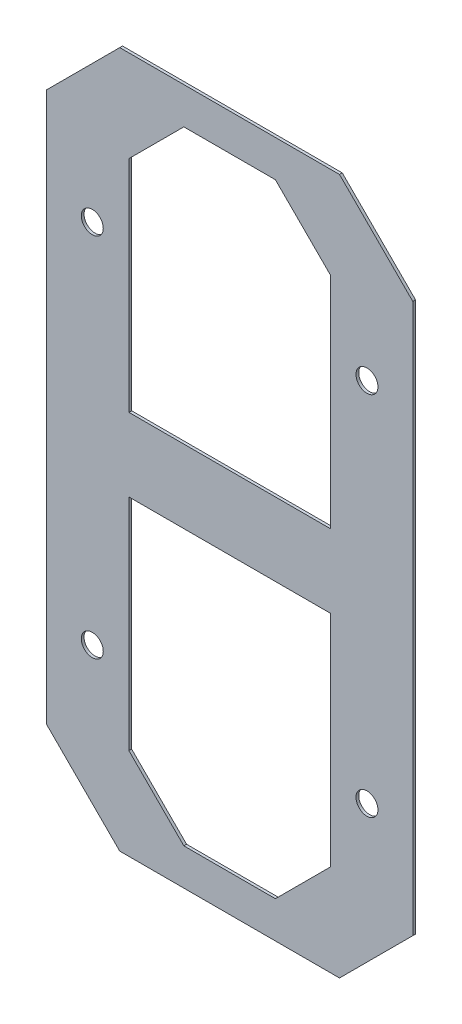
ISO-10303-21;
HEADER;
FILE_DESCRIPTION(('STEP AP214'),'2;1');
FILE_NAME('part.step','',(''),(''),'','','');
FILE_SCHEMA(('AUTOMOTIVE_DESIGN { 1 0 10303 214 1 1 1 1 }'));
ENDSEC;
DATA;
#1=APPLICATION_CONTEXT('core data for automotive mechanical design processes');
#2=APPLICATION_PROTOCOL_DEFINITION('international standard','automotive_design',2000,#1);
#3=PRODUCT_CONTEXT('',#1,'mechanical');
#4=PRODUCT('Part','Part','',(#3));
#5=PRODUCT_RELATED_PRODUCT_CATEGORY('part','',(#4));
#6=PRODUCT_DEFINITION_FORMATION('','',#4);
#7=PRODUCT_DEFINITION_CONTEXT('part definition',#1,'design');
#8=PRODUCT_DEFINITION('design','',#6,#7);
#9=PRODUCT_DEFINITION_SHAPE('','',#8);
#10=(LENGTH_UNIT() NAMED_UNIT(*) SI_UNIT(.MILLI.,.METRE.));
#11=(NAMED_UNIT(*) PLANE_ANGLE_UNIT() SI_UNIT($,.RADIAN.));
#12=(NAMED_UNIT(*) SI_UNIT($,.STERADIAN.) SOLID_ANGLE_UNIT());
#13=UNCERTAINTY_MEASURE_WITH_UNIT(LENGTH_MEASURE(1.E-05),#10,'distance_accuracy_value','');
#14=(GEOMETRIC_REPRESENTATION_CONTEXT(3) GLOBAL_UNCERTAINTY_ASSIGNED_CONTEXT((#13)) GLOBAL_UNIT_ASSIGNED_CONTEXT((#10,
#11,#12)) REPRESENTATION_CONTEXT('',''));
#15=CARTESIAN_POINT('',(0.,0.,0.));
#16=DIRECTION('',(0.,0.,1.));
#17=DIRECTION('',(1.,0.,0.));
#18=AXIS2_PLACEMENT_3D('',#15,#16,#17);
#19=CARTESIAN_POINT('',(-254.,482.6,3.81));
#20=DIRECTION('',(0.,1.,0.));
#21=DIRECTION('',(0.,0.,1.));
#22=AXIS2_PLACEMENT_3D('',#19,#20,#21);
#23=PLANE('',#22);
#24=DIRECTION('',(1.,0.,0.));
#25=VECTOR('',#24,1.);
#26=CARTESIAN_POINT('',(-254.,482.6,0.));
#27=LINE('',#26,#25);
#28=CARTESIAN_POINT('',(-152.4,482.6,0.));
#29=VERTEX_POINT('',#28);
#30=CARTESIAN_POINT('',(152.4,482.6,0.));
#31=VERTEX_POINT('',#30);
#32=EDGE_CURVE('E352',#29,#31,#27,.T.);
#33=ORIENTED_EDGE('',*,*,#32,.F.);
#34=DIRECTION('',(0.,0.,1.));
#35=VECTOR('',#34,1.);
#36=CARTESIAN_POINT('',(-152.4,482.6,3.81));
#37=LINE('',#36,#35);
#38=CARTESIAN_POINT('',(-152.4,482.6,3.81));
#39=VERTEX_POINT('',#38);
#40=EDGE_CURVE('E407',#29,#39,#37,.T.);
#41=ORIENTED_EDGE('',*,*,#40,.T.);
#42=DIRECTION('',(1.,0.,0.));
#43=VECTOR('',#42,1.);
#44=CARTESIAN_POINT('',(-254.,482.6,3.81));
#45=LINE('',#44,#43);
#46=CARTESIAN_POINT('',(152.4,482.6,3.81));
#47=VERTEX_POINT('',#46);
#48=EDGE_CURVE('E353',#39,#47,#45,.T.);
#49=ORIENTED_EDGE('',*,*,#48,.T.);
#50=DIRECTION('',(0.,0.,-1.));
#51=VECTOR('',#50,1.);
#52=CARTESIAN_POINT('',(152.4,482.6,3.81));
#53=LINE('',#52,#51);
#54=EDGE_CURVE('E403',#47,#31,#53,.T.);
#55=ORIENTED_EDGE('',*,*,#54,.T.);
#56=EDGE_LOOP('',(#33,#41,#49,#55));
#57=FACE_BOUND('',#56,.T.);
#58=ADVANCED_FACE('F45',(#57),#23,.T.);
#59=CARTESIAN_POINT('',(-254.,482.6,3.81));
#60=DIRECTION('',(1.,0.,0.));
#61=DIRECTION('',(0.,1.,0.));
#62=AXIS2_PLACEMENT_3D('',#59,#60,#61);
#63=PLANE('',#62);
#64=DIRECTION('',(0.,-1.,0.));
#65=VECTOR('',#64,1.);
#66=CARTESIAN_POINT('',(-254.,482.6,3.81));
#67=LINE('',#66,#65);
#68=CARTESIAN_POINT('',(-254.,381.,3.81));
#69=VERTEX_POINT('',#68);
#70=CARTESIAN_POINT('',(-254.,-380.999999999999,3.81));
#71=VERTEX_POINT('',#70);
#72=EDGE_CURVE('E366',#69,#71,#67,.T.);
#73=ORIENTED_EDGE('',*,*,#72,.F.);
#74=DIRECTION('',(0.,0.,-1.));
#75=VECTOR('',#74,1.);
#76=CARTESIAN_POINT('',(-254.,381.,0.));
#77=LINE('',#76,#75);
#78=CARTESIAN_POINT('',(-254.,381.,0.));
#79=VERTEX_POINT('',#78);
#80=EDGE_CURVE('E387',#69,#79,#77,.T.);
#81=ORIENTED_EDGE('',*,*,#80,.T.);
#82=DIRECTION('',(0.,-1.,0.));
#83=VECTOR('',#82,1.);
#84=CARTESIAN_POINT('',(-254.,482.6,0.));
#85=LINE('',#84,#83);
#86=CARTESIAN_POINT('',(-254.,-380.999999999999,0.));
#87=VERTEX_POINT('',#86);
#88=EDGE_CURVE('E358',#79,#87,#85,.T.);
#89=ORIENTED_EDGE('',*,*,#88,.T.);
#90=DIRECTION('',(0.,0.,1.));
#91=VECTOR('',#90,1.);
#92=CARTESIAN_POINT('',(-254.,-380.999999999999,3.81));
#93=LINE('',#92,#91);
#94=EDGE_CURVE('E370',#87,#71,#93,.T.);
#95=ORIENTED_EDGE('',*,*,#94,.T.);
#96=EDGE_LOOP('',(#73,#81,#89,#95));
#97=FACE_BOUND('',#96,.T.);
#98=ADVANCED_FACE('F465',(#97),#63,.F.);
#99=CARTESIAN_POINT('',(-254.,-482.6,3.81));
#100=DIRECTION('',(0.,1.,0.));
#101=DIRECTION('',(0.,0.,1.));
#102=AXIS2_PLACEMENT_3D('',#99,#100,#101);
#103=PLANE('',#102);
#104=DIRECTION('',(1.,0.,0.));
#105=VECTOR('',#104,1.);
#106=CARTESIAN_POINT('',(-254.,-482.6,0.));
#107=LINE('',#106,#105);
#108=CARTESIAN_POINT('',(-152.4,-482.6,0.));
#109=VERTEX_POINT('',#108);
#110=CARTESIAN_POINT('',(152.4,-482.6,0.));
#111=VERTEX_POINT('',#110);
#112=EDGE_CURVE('E378',#109,#111,#107,.T.);
#113=ORIENTED_EDGE('',*,*,#112,.T.);
#114=DIRECTION('',(0.,0.,1.));
#115=VECTOR('',#114,1.);
#116=CARTESIAN_POINT('',(152.4,-482.6,3.81));
#117=LINE('',#116,#115);
#118=CARTESIAN_POINT('',(152.4,-482.6,3.81));
#119=VERTEX_POINT('',#118);
#120=EDGE_CURVE('E11',#111,#119,#117,.T.);
#121=ORIENTED_EDGE('',*,*,#120,.T.);
#122=DIRECTION('',(1.,0.,0.));
#123=VECTOR('',#122,1.);
#124=CARTESIAN_POINT('',(-254.,-482.6,3.81));
#125=LINE('',#124,#123);
#126=CARTESIAN_POINT('',(-152.4,-482.6,3.81));
#127=VERTEX_POINT('',#126);
#128=EDGE_CURVE('E362',#127,#119,#125,.T.);
#129=ORIENTED_EDGE('',*,*,#128,.F.);
#130=DIRECTION('',(0.,0.,-1.));
#131=VECTOR('',#130,1.);
#132=CARTESIAN_POINT('',(-152.4,-482.6,3.81));
#133=LINE('',#132,#131);
#134=EDGE_CURVE('E55',#127,#109,#133,.T.);
#135=ORIENTED_EDGE('',*,*,#134,.T.);
#136=EDGE_LOOP('',(#113,#121,#129,#135));
#137=FACE_BOUND('',#136,.T.);
#138=ADVANCED_FACE('F434',(#137),#103,.F.);
#139=CARTESIAN_POINT('',(254.,482.6,3.81));
#140=DIRECTION('',(1.,0.,0.));
#141=DIRECTION('',(0.,1.,0.));
#142=AXIS2_PLACEMENT_3D('',#139,#140,#141);
#143=PLANE('',#142);
#144=DIRECTION('',(0.,-1.,0.));
#145=VECTOR('',#144,1.);
#146=CARTESIAN_POINT('',(254.,482.6,0.));
#147=LINE('',#146,#145);
#148=CARTESIAN_POINT('',(254.,381.,0.));
#149=VERTEX_POINT('',#148);
#150=CARTESIAN_POINT('',(254.,-381.,0.));
#151=VERTEX_POINT('',#150);
#152=EDGE_CURVE('E374',#149,#151,#147,.T.);
#153=ORIENTED_EDGE('',*,*,#152,.F.);
#154=DIRECTION('',(0.,0.,1.));
#155=VECTOR('',#154,1.);
#156=CARTESIAN_POINT('',(254.,381.,3.81));
#157=LINE('',#156,#155);
#158=CARTESIAN_POINT('',(254.,381.,3.81));
#159=VERTEX_POINT('',#158);
#160=EDGE_CURVE('E426',#149,#159,#157,.T.);
#161=ORIENTED_EDGE('',*,*,#160,.T.);
#162=DIRECTION('',(0.,-1.,0.));
#163=VECTOR('',#162,1.);
#164=CARTESIAN_POINT('',(254.,482.6,3.81));
#165=LINE('',#164,#163);
#166=CARTESIAN_POINT('',(254.,-381.,3.81));
#167=VERTEX_POINT('',#166);
#168=EDGE_CURVE('E357',#159,#167,#165,.T.);
#169=ORIENTED_EDGE('',*,*,#168,.T.);
#170=DIRECTION('',(0.,0.,-1.));
#171=VECTOR('',#170,1.);
#172=CARTESIAN_POINT('',(254.,-381.,0.));
#173=LINE('',#172,#171);
#174=EDGE_CURVE('E422',#167,#151,#173,.T.);
#175=ORIENTED_EDGE('',*,*,#174,.T.);
#176=EDGE_LOOP('',(#153,#161,#169,#175));
#177=FACE_BOUND('',#176,.T.);
#178=ADVANCED_FACE('F446',(#177),#143,.T.);
#179=CARTESIAN_POINT('',(0.,0.,3.81));
#180=DIRECTION('',(0.,0.,-1.));
#181=DIRECTION('',(-1.,0.,0.));
#182=AXIS2_PLACEMENT_3D('',#179,#180,#181);
#183=PLANE('',#182);
#184=DIRECTION('',(-0.707106781186548,0.707106781186547,0.));
#185=VECTOR('',#184,1.);
#186=CARTESIAN_POINT('',(63.4999999999999,431.8,3.81));
#187=LINE('',#186,#185);
#188=CARTESIAN_POINT('',(139.7,355.6,3.81));
#189=VERTEX_POINT('',#188);
#190=CARTESIAN_POINT('',(63.4999999999999,431.8,3.81));
#191=VERTEX_POINT('',#190);
#192=EDGE_CURVE('E228',#189,#191,#187,.T.);
#193=ORIENTED_EDGE('',*,*,#192,.F.);
#194=DIRECTION('',(0.,1.,0.));
#195=VECTOR('',#194,1.);
#196=CARTESIAN_POINT('',(139.7,355.6,3.81));
#197=LINE('',#196,#195);
#198=CARTESIAN_POINT('',(139.7,50.8,3.81));
#199=VERTEX_POINT('',#198);
#200=EDGE_CURVE('E62',#199,#189,#197,.T.);
#201=ORIENTED_EDGE('',*,*,#200,.F.);
#202=DIRECTION('',(1.,0.,0.));
#203=VECTOR('',#202,1.);
#204=CARTESIAN_POINT('',(-139.7,50.8,3.81));
#205=LINE('',#204,#203);
#206=CARTESIAN_POINT('',(-139.7,50.8,3.81));
#207=VERTEX_POINT('',#206);
#208=EDGE_CURVE('E208',#207,#199,#205,.T.);
#209=ORIENTED_EDGE('',*,*,#208,.F.);
#210=DIRECTION('',(0.,-1.,0.));
#211=VECTOR('',#210,1.);
#212=CARTESIAN_POINT('',(-139.7,355.6,3.81));
#213=LINE('',#212,#211);
#214=CARTESIAN_POINT('',(-139.7,355.6,3.81));
#215=VERTEX_POINT('',#214);
#216=EDGE_CURVE('E212',#215,#207,#213,.T.);
#217=ORIENTED_EDGE('',*,*,#216,.F.);
#218=DIRECTION('',(-0.707106781186548,-0.707106781186548,0.));
#219=VECTOR('',#218,1.);
#220=CARTESIAN_POINT('',(-139.7,355.6,3.81));
#221=LINE('',#220,#219);
#222=CARTESIAN_POINT('',(-63.5000000000001,431.8,3.81));
#223=VERTEX_POINT('',#222);
#224=EDGE_CURVE('E235',#223,#215,#221,.T.);
#225=ORIENTED_EDGE('',*,*,#224,.F.);
#226=DIRECTION('',(-1.,0.,0.));
#227=VECTOR('',#226,1.);
#228=CARTESIAN_POINT('',(-63.5000000000001,431.8,3.81));
#229=LINE('',#228,#227);
#230=EDGE_CURVE('E231',#191,#223,#229,.T.);
#231=ORIENTED_EDGE('',*,*,#230,.F.);
#232=EDGE_LOOP('',(#193,#201,#209,#217,#225,#231));
#233=FACE_BOUND('',#232,.T.);
#234=DIRECTION('',(0.707106781186547,-0.707106781186548,0.));
#235=VECTOR('',#234,1.);
#236=CARTESIAN_POINT('',(-63.5000000000001,-431.8,3.81));
#237=LINE('',#236,#235);
#238=CARTESIAN_POINT('',(-139.7,-355.6,3.81));
#239=VERTEX_POINT('',#238);
#240=CARTESIAN_POINT('',(-63.5000000000001,-431.8,3.81));
#241=VERTEX_POINT('',#240);
#242=EDGE_CURVE('E293',#239,#241,#237,.T.);
#243=ORIENTED_EDGE('',*,*,#242,.F.);
#244=DIRECTION('',(0.,-1.,0.));
#245=VECTOR('',#244,1.);
#246=CARTESIAN_POINT('',(-139.7,-355.6,3.81));
#247=LINE('',#246,#245);
#248=CARTESIAN_POINT('',(-139.7,-50.8,3.81));
#249=VERTEX_POINT('',#248);
#250=EDGE_CURVE('E70',#249,#239,#247,.T.);
#251=ORIENTED_EDGE('',*,*,#250,.F.);
#252=DIRECTION('',(-1.,0.,0.));
#253=VECTOR('',#252,1.);
#254=CARTESIAN_POINT('',(-139.7,-50.8,3.81));
#255=LINE('',#254,#253);
#256=CARTESIAN_POINT('',(139.7,-50.8,3.81));
#257=VERTEX_POINT('',#256);
#258=EDGE_CURVE('E276',#257,#249,#255,.T.);
#259=ORIENTED_EDGE('',*,*,#258,.F.);
#260=DIRECTION('',(0.,1.,0.));
#261=VECTOR('',#260,1.);
#262=CARTESIAN_POINT('',(139.7,-355.6,3.81));
#263=LINE('',#262,#261);
#264=CARTESIAN_POINT('',(139.7,-355.6,3.81));
#265=VERTEX_POINT('',#264);
#266=EDGE_CURVE('E280',#265,#257,#263,.T.);
#267=ORIENTED_EDGE('',*,*,#266,.F.);
#268=DIRECTION('',(0.707106781186548,0.707106781186547,0.));
#269=VECTOR('',#268,1.);
#270=CARTESIAN_POINT('',(63.4999999999999,-431.8,3.81));
#271=LINE('',#270,#269);
#272=CARTESIAN_POINT('',(63.4999999999999,-431.8,3.81));
#273=VERTEX_POINT('',#272);
#274=EDGE_CURVE('E285',#273,#265,#271,.T.);
#275=ORIENTED_EDGE('',*,*,#274,.F.);
#276=DIRECTION('',(1.,0.,0.));
#277=VECTOR('',#276,1.);
#278=CARTESIAN_POINT('',(-63.5000000000001,-431.8,3.81));
#279=LINE('',#278,#277);
#280=EDGE_CURVE('E289',#241,#273,#279,.T.);
#281=ORIENTED_EDGE('',*,*,#280,.F.);
#282=EDGE_LOOP('',(#243,#251,#259,#267,#275,#281));
#283=FACE_BOUND('',#282,.T.);
#284=CARTESIAN_POINT('',(-190.5,254.,3.81));
#285=DIRECTION('',(0.,0.,1.));
#286=DIRECTION('',(1.,0.,0.));
#287=AXIS2_PLACEMENT_3D('',#284,#285,#286);
#288=CIRCLE('',#287,15.24);
#289=CARTESIAN_POINT('',(-175.26,254.,3.81));
#290=VERTEX_POINT('',#289);
#291=EDGE_CURVE('E245',#290,#290,#288,.T.);
#292=ORIENTED_EDGE('',*,*,#291,.F.);
#293=EDGE_LOOP('',(#292));
#294=FACE_BOUND('',#293,.T.);
#295=CARTESIAN_POINT('',(190.5,254.,3.81));
#296=DIRECTION('',(0.,0.,1.));
#297=DIRECTION('',(1.,0.,0.));
#298=AXIS2_PLACEMENT_3D('',#295,#296,#297);
#299=CIRCLE('',#298,15.24);
#300=CARTESIAN_POINT('',(205.74,254.,3.81));
#301=VERTEX_POINT('',#300);
#302=EDGE_CURVE('E328',#301,#301,#299,.T.);
#303=ORIENTED_EDGE('',*,*,#302,.F.);
#304=EDGE_LOOP('',(#303));
#305=FACE_BOUND('',#304,.T.);
#306=CARTESIAN_POINT('',(190.5,-254.,3.81));
#307=DIRECTION('',(0.,0.,1.));
#308=DIRECTION('',(1.,0.,0.));
#309=AXIS2_PLACEMENT_3D('',#306,#307,#308);
#310=CIRCLE('',#309,15.24);
#311=CARTESIAN_POINT('',(205.74,-254.,3.81));
#312=VERTEX_POINT('',#311);
#313=EDGE_CURVE('E336',#312,#312,#310,.T.);
#314=ORIENTED_EDGE('',*,*,#313,.F.);
#315=EDGE_LOOP('',(#314));
#316=FACE_BOUND('',#315,.T.);
#317=CARTESIAN_POINT('',(-190.5,-254.,3.81));
#318=DIRECTION('',(0.,0.,1.));
#319=DIRECTION('',(1.,0.,0.));
#320=AXIS2_PLACEMENT_3D('',#317,#318,#319);
#321=CIRCLE('',#320,15.24);
#322=CARTESIAN_POINT('',(-175.26,-254.,3.81));
#323=VERTEX_POINT('',#322);
#324=EDGE_CURVE('E344',#323,#323,#321,.T.);
#325=ORIENTED_EDGE('',*,*,#324,.F.);
#326=EDGE_LOOP('',(#325));
#327=FACE_BOUND('',#326,.T.);
#328=ORIENTED_EDGE('',*,*,#48,.F.);
#329=DIRECTION('',(-0.707106781186548,-0.707106781186547,0.));
#330=VECTOR('',#329,1.);
#331=CARTESIAN_POINT('',(-254.,381.,3.81));
#332=LINE('',#331,#330);
#333=EDGE_CURVE('E419',#39,#69,#332,.T.);
#334=ORIENTED_EDGE('',*,*,#333,.T.);
#335=ORIENTED_EDGE('',*,*,#72,.T.);
#336=DIRECTION('',(-0.707106781186546,0.707106781186549,0.));
#337=VECTOR('',#336,1.);
#338=CARTESIAN_POINT('',(-152.4,-482.6,3.81));
#339=LINE('',#338,#337);
#340=EDGE_CURVE('E410',#71,#127,#339,.F.);
#341=ORIENTED_EDGE('',*,*,#340,.T.);
#342=ORIENTED_EDGE('',*,*,#128,.T.);
#343=DIRECTION('',(0.707106781186548,0.707106781186547,0.));
#344=VECTOR('',#343,1.);
#345=CARTESIAN_POINT('',(254.,-381.,3.81));
#346=LINE('',#345,#344);
#347=EDGE_CURVE('E413',#119,#167,#346,.T.);
#348=ORIENTED_EDGE('',*,*,#347,.T.);
#349=ORIENTED_EDGE('',*,*,#168,.F.);
#350=DIRECTION('',(0.707106781186546,-0.707106781186549,0.));
#351=VECTOR('',#350,1.);
#352=CARTESIAN_POINT('',(152.4,482.6,3.81));
#353=LINE('',#352,#351);
#354=EDGE_CURVE('E416',#159,#47,#353,.F.);
#355=ORIENTED_EDGE('',*,*,#354,.T.);
#356=EDGE_LOOP('',(#328,#334,#335,#341,#342,#348,#349,#355));
#357=FACE_BOUND('',#356,.T.);
#358=ADVANCED_FACE('F452',(#233,#283,#294,#305,#316,#327,#357),#183,.F.);
#359=CARTESIAN_POINT('',(0.,0.,0.));
#360=DIRECTION('',(0.,0.,-1.));
#361=DIRECTION('',(-1.,0.,0.));
#362=AXIS2_PLACEMENT_3D('',#359,#360,#361);
#363=PLANE('',#362);
#364=DIRECTION('',(0.,1.,0.));
#365=VECTOR('',#364,1.);
#366=CARTESIAN_POINT('',(139.7,355.6,0.));
#367=LINE('',#366,#365);
#368=CARTESIAN_POINT('',(139.7,50.8,0.));
#369=VERTEX_POINT('',#368);
#370=CARTESIAN_POINT('',(139.7,355.6,0.));
#371=VERTEX_POINT('',#370);
#372=EDGE_CURVE('E185',#369,#371,#367,.T.);
#373=ORIENTED_EDGE('',*,*,#372,.T.);
#374=DIRECTION('',(-0.707106781186548,0.707106781186547,0.));
#375=VECTOR('',#374,1.);
#376=CARTESIAN_POINT('',(63.4999999999999,431.8,0.));
#377=LINE('',#376,#375);
#378=CARTESIAN_POINT('',(63.4999999999999,431.8,0.));
#379=VERTEX_POINT('',#378);
#380=EDGE_CURVE('E196',#371,#379,#377,.T.);
#381=ORIENTED_EDGE('',*,*,#380,.T.);
#382=DIRECTION('',(-1.,0.,0.));
#383=VECTOR('',#382,1.);
#384=CARTESIAN_POINT('',(-63.5000000000001,431.8,0.));
#385=LINE('',#384,#383);
#386=CARTESIAN_POINT('',(-63.5000000000001,431.8,0.));
#387=VERTEX_POINT('',#386);
#388=EDGE_CURVE('E201',#379,#387,#385,.T.);
#389=ORIENTED_EDGE('',*,*,#388,.T.);
#390=DIRECTION('',(-0.707106781186548,-0.707106781186548,0.));
#391=VECTOR('',#390,1.);
#392=CARTESIAN_POINT('',(-139.7,355.6,0.));
#393=LINE('',#392,#391);
#394=CARTESIAN_POINT('',(-139.7,355.6,0.));
#395=VERTEX_POINT('',#394);
#396=EDGE_CURVE('E217',#387,#395,#393,.T.);
#397=ORIENTED_EDGE('',*,*,#396,.T.);
#398=DIRECTION('',(0.,-1.,0.));
#399=VECTOR('',#398,1.);
#400=CARTESIAN_POINT('',(-139.7,355.6,0.));
#401=LINE('',#400,#399);
#402=CARTESIAN_POINT('',(-139.7,50.8,0.));
#403=VERTEX_POINT('',#402);
#404=EDGE_CURVE('E221',#395,#403,#401,.T.);
#405=ORIENTED_EDGE('',*,*,#404,.T.);
#406=DIRECTION('',(1.,0.,0.));
#407=VECTOR('',#406,1.);
#408=CARTESIAN_POINT('',(-139.7,50.8,0.));
#409=LINE('',#408,#407);
#410=EDGE_CURVE('E192',#403,#369,#409,.T.);
#411=ORIENTED_EDGE('',*,*,#410,.T.);
#412=EDGE_LOOP('',(#373,#381,#389,#397,#405,#411));
#413=FACE_BOUND('',#412,.T.);
#414=DIRECTION('',(0.,-1.,0.));
#415=VECTOR('',#414,1.);
#416=CARTESIAN_POINT('',(-139.7,-355.6,0.));
#417=LINE('',#416,#415);
#418=CARTESIAN_POINT('',(-139.7,-50.8,0.));
#419=VERTEX_POINT('',#418);
#420=CARTESIAN_POINT('',(-139.7,-355.6,0.));
#421=VERTEX_POINT('',#420);
#422=EDGE_CURVE('E281',#419,#421,#417,.T.);
#423=ORIENTED_EDGE('',*,*,#422,.T.);
#424=DIRECTION('',(0.707106781186547,-0.707106781186548,0.));
#425=VECTOR('',#424,1.);
#426=CARTESIAN_POINT('',(-63.5000000000001,-431.8,0.));
#427=LINE('',#426,#425);
#428=CARTESIAN_POINT('',(-63.5000000000001,-431.8,0.));
#429=VERTEX_POINT('',#428);
#430=EDGE_CURVE('E314',#421,#429,#427,.T.);
#431=ORIENTED_EDGE('',*,*,#430,.T.);
#432=DIRECTION('',(1.,0.,0.));
#433=VECTOR('',#432,1.);
#434=CARTESIAN_POINT('',(-63.5000000000001,-431.8,0.));
#435=LINE('',#434,#433);
#436=CARTESIAN_POINT('',(63.4999999999999,-431.8,0.));
#437=VERTEX_POINT('',#436);
#438=EDGE_CURVE('E310',#429,#437,#435,.T.);
#439=ORIENTED_EDGE('',*,*,#438,.T.);
#440=DIRECTION('',(0.707106781186548,0.707106781186547,0.));
#441=VECTOR('',#440,1.);
#442=CARTESIAN_POINT('',(63.4999999999999,-431.8,0.));
#443=LINE('',#442,#441);
#444=CARTESIAN_POINT('',(139.7,-355.6,0.));
#445=VERTEX_POINT('',#444);
#446=EDGE_CURVE('E306',#437,#445,#443,.T.);
#447=ORIENTED_EDGE('',*,*,#446,.T.);
#448=DIRECTION('',(0.,1.,0.));
#449=VECTOR('',#448,1.);
#450=CARTESIAN_POINT('',(139.7,-355.6,0.));
#451=LINE('',#450,#449);
#452=CARTESIAN_POINT('',(139.7,-50.8,0.));
#453=VERTEX_POINT('',#452);
#454=EDGE_CURVE('E302',#445,#453,#451,.T.);
#455=ORIENTED_EDGE('',*,*,#454,.T.);
#456=DIRECTION('',(-1.,0.,0.));
#457=VECTOR('',#456,1.);
#458=CARTESIAN_POINT('',(-139.7,-50.8,0.));
#459=LINE('',#458,#457);
#460=EDGE_CURVE('E260',#453,#419,#459,.T.);
#461=ORIENTED_EDGE('',*,*,#460,.T.);
#462=EDGE_LOOP('',(#423,#431,#439,#447,#455,#461));
#463=FACE_BOUND('',#462,.T.);
#464=CARTESIAN_POINT('',(-190.5,254.,0.));
#465=DIRECTION('',(0.,0.,1.));
#466=DIRECTION('',(1.,0.,0.));
#467=AXIS2_PLACEMENT_3D('',#464,#465,#466);
#468=CIRCLE('',#467,15.24);
#469=CARTESIAN_POINT('',(-175.26,254.,0.));
#470=VERTEX_POINT('',#469);
#471=EDGE_CURVE('E324',#470,#470,#468,.T.);
#472=ORIENTED_EDGE('',*,*,#471,.T.);
#473=EDGE_LOOP('',(#472));
#474=FACE_BOUND('',#473,.T.);
#475=CARTESIAN_POINT('',(190.5,254.,0.));
#476=DIRECTION('',(0.,0.,1.));
#477=DIRECTION('',(1.,0.,0.));
#478=AXIS2_PLACEMENT_3D('',#475,#476,#477);
#479=CIRCLE('',#478,15.24);
#480=CARTESIAN_POINT('',(205.74,254.,0.));
#481=VERTEX_POINT('',#480);
#482=EDGE_CURVE('E332',#481,#481,#479,.T.);
#483=ORIENTED_EDGE('',*,*,#482,.T.);
#484=EDGE_LOOP('',(#483));
#485=FACE_BOUND('',#484,.T.);
#486=CARTESIAN_POINT('',(190.5,-254.,0.));
#487=DIRECTION('',(0.,0.,1.));
#488=DIRECTION('',(1.,0.,0.));
#489=AXIS2_PLACEMENT_3D('',#486,#487,#488);
#490=CIRCLE('',#489,15.24);
#491=CARTESIAN_POINT('',(205.74,-254.,0.));
#492=VERTEX_POINT('',#491);
#493=EDGE_CURVE('E340',#492,#492,#490,.T.);
#494=ORIENTED_EDGE('',*,*,#493,.T.);
#495=EDGE_LOOP('',(#494));
#496=FACE_BOUND('',#495,.T.);
#497=CARTESIAN_POINT('',(-190.5,-254.,0.));
#498=DIRECTION('',(0.,0.,1.));
#499=DIRECTION('',(1.,0.,0.));
#500=AXIS2_PLACEMENT_3D('',#497,#498,#499);
#501=CIRCLE('',#500,15.24);
#502=CARTESIAN_POINT('',(-175.26,-254.,0.));
#503=VERTEX_POINT('',#502);
#504=EDGE_CURVE('E348',#503,#503,#501,.T.);
#505=ORIENTED_EDGE('',*,*,#504,.T.);
#506=EDGE_LOOP('',(#505));
#507=FACE_BOUND('',#506,.T.);
#508=ORIENTED_EDGE('',*,*,#88,.F.);
#509=DIRECTION('',(0.707106781186548,0.707106781186547,0.));
#510=VECTOR('',#509,1.);
#511=CARTESIAN_POINT('',(-317.5,317.500000000001,0.));
#512=LINE('',#511,#510);
#513=EDGE_CURVE('E400',#79,#29,#512,.T.);
#514=ORIENTED_EDGE('',*,*,#513,.T.);
#515=ORIENTED_EDGE('',*,*,#32,.T.);
#516=DIRECTION('',(-0.707106781186546,0.707106781186549,0.));
#517=VECTOR('',#516,1.);
#518=CARTESIAN_POINT('',(317.5,317.499999999999,0.));
#519=LINE('',#518,#517);
#520=EDGE_CURVE('E397',#31,#149,#519,.F.);
#521=ORIENTED_EDGE('',*,*,#520,.T.);
#522=ORIENTED_EDGE('',*,*,#152,.T.);
#523=DIRECTION('',(-0.707106781186548,-0.707106781186547,0.));
#524=VECTOR('',#523,1.);
#525=CARTESIAN_POINT('',(317.5,-317.500000000001,0.));
#526=LINE('',#525,#524);
#527=EDGE_CURVE('E394',#151,#111,#526,.T.);
#528=ORIENTED_EDGE('',*,*,#527,.T.);
#529=ORIENTED_EDGE('',*,*,#112,.F.);
#530=DIRECTION('',(0.707106781186546,-0.707106781186549,0.));
#531=VECTOR('',#530,1.);
#532=CARTESIAN_POINT('',(-317.5,-317.499999999999,0.));
#533=LINE('',#532,#531);
#534=EDGE_CURVE('E391',#109,#87,#533,.F.);
#535=ORIENTED_EDGE('',*,*,#534,.T.);
#536=EDGE_LOOP('',(#508,#514,#515,#521,#522,#528,#529,#535));
#537=FACE_BOUND('',#536,.T.);
#538=ADVANCED_FACE('F203',(#413,#463,#474,#485,#496,#507,#537),#363,.T.);
#539=CARTESIAN_POINT('',(-190.5,-254.,3.81));
#540=DIRECTION('',(0.,0.,1.));
#541=DIRECTION('',(1.,0.,0.));
#542=AXIS2_PLACEMENT_3D('',#539,#540,#541);
#543=CYLINDRICAL_SURFACE('',#542,15.24);
#544=ORIENTED_EDGE('',*,*,#504,.F.);
#545=EDGE_LOOP('',(#544));
#546=FACE_BOUND('',#545,.T.);
#547=ORIENTED_EDGE('',*,*,#324,.T.);
#548=EDGE_LOOP('',(#547));
#549=FACE_BOUND('',#548,.T.);
#550=ADVANCED_FACE('F536',(#546,#549),#543,.F.);
#551=CARTESIAN_POINT('',(190.5,-254.,3.81));
#552=DIRECTION('',(0.,0.,1.));
#553=DIRECTION('',(1.,0.,0.));
#554=AXIS2_PLACEMENT_3D('',#551,#552,#553);
#555=CYLINDRICAL_SURFACE('',#554,15.24);
#556=ORIENTED_EDGE('',*,*,#493,.F.);
#557=EDGE_LOOP('',(#556));
#558=FACE_BOUND('',#557,.T.);
#559=ORIENTED_EDGE('',*,*,#313,.T.);
#560=EDGE_LOOP('',(#559));
#561=FACE_BOUND('',#560,.T.);
#562=ADVANCED_FACE('F702',(#558,#561),#555,.F.);
#563=CARTESIAN_POINT('',(190.5,254.,3.81));
#564=DIRECTION('',(0.,0.,1.));
#565=DIRECTION('',(1.,0.,0.));
#566=AXIS2_PLACEMENT_3D('',#563,#564,#565);
#567=CYLINDRICAL_SURFACE('',#566,15.24);
#568=ORIENTED_EDGE('',*,*,#482,.F.);
#569=EDGE_LOOP('',(#568));
#570=FACE_BOUND('',#569,.T.);
#571=ORIENTED_EDGE('',*,*,#302,.T.);
#572=EDGE_LOOP('',(#571));
#573=FACE_BOUND('',#572,.T.);
#574=ADVANCED_FACE('F692',(#570,#573),#567,.F.);
#575=CARTESIAN_POINT('',(-190.5,254.,3.81));
#576=DIRECTION('',(0.,0.,1.));
#577=DIRECTION('',(1.,0.,0.));
#578=AXIS2_PLACEMENT_3D('',#575,#576,#577);
#579=CYLINDRICAL_SURFACE('',#578,15.24);
#580=ORIENTED_EDGE('',*,*,#471,.F.);
#581=EDGE_LOOP('',(#580));
#582=FACE_BOUND('',#581,.T.);
#583=ORIENTED_EDGE('',*,*,#291,.T.);
#584=EDGE_LOOP('',(#583));
#585=FACE_BOUND('',#584,.T.);
#586=ADVANCED_FACE('F490',(#582,#585),#579,.F.);
#587=CARTESIAN_POINT('',(-254.,381.,3.81));
#588=DIRECTION('',(-0.707106781186547,0.707106781186548,0.));
#589=DIRECTION('',(0.,0.,1.));
#590=AXIS2_PLACEMENT_3D('',#587,#588,#589);
#591=PLANE('',#590);
#592=ORIENTED_EDGE('',*,*,#333,.F.);
#593=ORIENTED_EDGE('',*,*,#40,.F.);
#594=ORIENTED_EDGE('',*,*,#513,.F.);
#595=ORIENTED_EDGE('',*,*,#80,.F.);
#596=EDGE_LOOP('',(#592,#593,#594,#595));
#597=FACE_BOUND('',#596,.T.);
#598=ADVANCED_FACE('F462',(#597),#591,.T.);
#599=CARTESIAN_POINT('',(152.4,482.6,3.81));
#600=DIRECTION('',(-0.707106781186549,-0.707106781186546,0.));
#601=DIRECTION('',(0.,0.,-1.));
#602=AXIS2_PLACEMENT_3D('',#599,#600,#601);
#603=PLANE('',#602);
#604=ORIENTED_EDGE('',*,*,#354,.F.);
#605=ORIENTED_EDGE('',*,*,#160,.F.);
#606=ORIENTED_EDGE('',*,*,#520,.F.);
#607=ORIENTED_EDGE('',*,*,#54,.F.);
#608=EDGE_LOOP('',(#604,#605,#606,#607));
#609=FACE_BOUND('',#608,.T.);
#610=ADVANCED_FACE('F455',(#609),#603,.F.);
#611=CARTESIAN_POINT('',(254.,-381.,3.81));
#612=DIRECTION('',(0.707106781186547,-0.707106781186548,0.));
#613=DIRECTION('',(0.,0.,1.));
#614=AXIS2_PLACEMENT_3D('',#611,#612,#613);
#615=PLANE('',#614);
#616=ORIENTED_EDGE('',*,*,#347,.F.);
#617=ORIENTED_EDGE('',*,*,#120,.F.);
#618=ORIENTED_EDGE('',*,*,#527,.F.);
#619=ORIENTED_EDGE('',*,*,#174,.F.);
#620=EDGE_LOOP('',(#616,#617,#618,#619));
#621=FACE_BOUND('',#620,.T.);
#622=ADVANCED_FACE('F444',(#621),#615,.T.);
#623=CARTESIAN_POINT('',(-152.4,-482.6,3.81));
#624=DIRECTION('',(0.707106781186549,0.707106781186546,0.));
#625=DIRECTION('',(0.,0.,-1.));
#626=AXIS2_PLACEMENT_3D('',#623,#624,#625);
#627=PLANE('',#626);
#628=ORIENTED_EDGE('',*,*,#340,.F.);
#629=ORIENTED_EDGE('',*,*,#94,.F.);
#630=ORIENTED_EDGE('',*,*,#534,.F.);
#631=ORIENTED_EDGE('',*,*,#134,.F.);
#632=EDGE_LOOP('',(#628,#629,#630,#631));
#633=FACE_BOUND('',#632,.T.);
#634=ADVANCED_FACE('F48',(#633),#627,.F.);
#635=CARTESIAN_POINT('',(-139.7,-355.6,0.));
#636=DIRECTION('',(-1.,0.,0.));
#637=DIRECTION('',(0.,-1.,0.));
#638=AXIS2_PLACEMENT_3D('',#635,#636,#637);
#639=PLANE('',#638);
#640=ORIENTED_EDGE('',*,*,#250,.T.);
#641=DIRECTION('',(0.,0.,1.));
#642=VECTOR('',#641,1.);
#643=CARTESIAN_POINT('',(-139.7,-355.6,0.));
#644=LINE('',#643,#642);
#645=EDGE_CURVE('E257',#421,#239,#644,.T.);
#646=ORIENTED_EDGE('',*,*,#645,.F.);
#647=ORIENTED_EDGE('',*,*,#422,.F.);
#648=DIRECTION('',(0.,0.,1.));
#649=VECTOR('',#648,1.);
#650=CARTESIAN_POINT('',(-139.7,-50.8,0.));
#651=LINE('',#650,#649);
#652=EDGE_CURVE('E273',#419,#249,#651,.T.);
#653=ORIENTED_EDGE('',*,*,#652,.T.);
#654=EDGE_LOOP('',(#640,#646,#647,#653));
#655=FACE_BOUND('',#654,.T.);
#656=ADVANCED_FACE('F468',(#655),#639,.F.);
#657=CARTESIAN_POINT('',(-139.7,-50.8,0.));
#658=DIRECTION('',(0.,1.,0.));
#659=DIRECTION('',(0.,0.,1.));
#660=AXIS2_PLACEMENT_3D('',#657,#658,#659);
#661=PLANE('',#660);
#662=ORIENTED_EDGE('',*,*,#258,.T.);
#663=ORIENTED_EDGE('',*,*,#652,.F.);
#664=ORIENTED_EDGE('',*,*,#460,.F.);
#665=DIRECTION('',(0.,0.,1.));
#666=VECTOR('',#665,1.);
#667=CARTESIAN_POINT('',(139.7,-50.8,0.));
#668=LINE('',#667,#666);
#669=EDGE_CURVE('E270',#453,#257,#668,.T.);
#670=ORIENTED_EDGE('',*,*,#669,.T.);
#671=EDGE_LOOP('',(#662,#663,#664,#670));
#672=FACE_BOUND('',#671,.T.);
#673=ADVANCED_FACE('F473',(#672),#661,.F.);
#674=CARTESIAN_POINT('',(139.7,-355.6,0.));
#675=DIRECTION('',(1.,0.,0.));
#676=DIRECTION('',(0.,1.,0.));
#677=AXIS2_PLACEMENT_3D('',#674,#675,#676);
#678=PLANE('',#677);
#679=ORIENTED_EDGE('',*,*,#266,.T.);
#680=ORIENTED_EDGE('',*,*,#669,.F.);
#681=ORIENTED_EDGE('',*,*,#454,.F.);
#682=DIRECTION('',(0.,0.,1.));
#683=VECTOR('',#682,1.);
#684=CARTESIAN_POINT('',(139.7,-355.6,0.));
#685=LINE('',#684,#683);
#686=EDGE_CURVE('E267',#445,#265,#685,.T.);
#687=ORIENTED_EDGE('',*,*,#686,.T.);
#688=EDGE_LOOP('',(#679,#680,#681,#687));
#689=FACE_BOUND('',#688,.T.);
#690=ADVANCED_FACE('F554',(#689),#678,.F.);
#691=CARTESIAN_POINT('',(63.4999999999999,-431.8,0.));
#692=DIRECTION('',(0.707106781186547,-0.707106781186548,0.));
#693=DIRECTION('',(0.707106781186548,0.707106781186547,0.));
#694=AXIS2_PLACEMENT_3D('',#691,#692,#693);
#695=PLANE('',#694);
#696=ORIENTED_EDGE('',*,*,#274,.T.);
#697=ORIENTED_EDGE('',*,*,#686,.F.);
#698=ORIENTED_EDGE('',*,*,#446,.F.);
#699=DIRECTION('',(0.,0.,1.));
#700=VECTOR('',#699,1.);
#701=CARTESIAN_POINT('',(63.4999999999999,-431.8,0.));
#702=LINE('',#701,#700);
#703=EDGE_CURVE('E264',#437,#273,#702,.T.);
#704=ORIENTED_EDGE('',*,*,#703,.T.);
#705=EDGE_LOOP('',(#696,#697,#698,#704));
#706=FACE_BOUND('',#705,.T.);
#707=ADVANCED_FACE('F565',(#706),#695,.F.);
#708=CARTESIAN_POINT('',(-63.5000000000001,-431.8,0.));
#709=DIRECTION('',(0.,-1.,0.));
#710=DIRECTION('',(0.,0.,-1.));
#711=AXIS2_PLACEMENT_3D('',#708,#709,#710);
#712=PLANE('',#711);
#713=ORIENTED_EDGE('',*,*,#280,.T.);
#714=ORIENTED_EDGE('',*,*,#703,.F.);
#715=ORIENTED_EDGE('',*,*,#438,.F.);
#716=DIRECTION('',(0.,0.,1.));
#717=VECTOR('',#716,1.);
#718=CARTESIAN_POINT('',(-63.5000000000001,-431.8,0.));
#719=LINE('',#718,#717);
#720=EDGE_CURVE('E261',#429,#241,#719,.T.);
#721=ORIENTED_EDGE('',*,*,#720,.T.);
#722=EDGE_LOOP('',(#713,#714,#715,#721));
#723=FACE_BOUND('',#722,.T.);
#724=ADVANCED_FACE('F576',(#723),#712,.F.);
#725=CARTESIAN_POINT('',(-63.5000000000001,-431.8,0.));
#726=DIRECTION('',(-0.707106781186548,-0.707106781186547,0.));
#727=DIRECTION('',(0.707106781186547,-0.707106781186548,0.));
#728=AXIS2_PLACEMENT_3D('',#725,#726,#727);
#729=PLANE('',#728);
#730=ORIENTED_EDGE('',*,*,#242,.T.);
#731=ORIENTED_EDGE('',*,*,#720,.F.);
#732=ORIENTED_EDGE('',*,*,#430,.F.);
#733=ORIENTED_EDGE('',*,*,#645,.T.);
#734=EDGE_LOOP('',(#730,#731,#732,#733));
#735=FACE_BOUND('',#734,.T.);
#736=ADVANCED_FACE('F587',(#735),#729,.F.);
#737=CARTESIAN_POINT('',(139.7,355.6,0.));
#738=DIRECTION('',(1.,0.,0.));
#739=DIRECTION('',(0.,1.,0.));
#740=AXIS2_PLACEMENT_3D('',#737,#738,#739);
#741=PLANE('',#740);
#742=ORIENTED_EDGE('',*,*,#200,.T.);
#743=DIRECTION('',(0.,0.,1.));
#744=VECTOR('',#743,1.);
#745=CARTESIAN_POINT('',(139.7,355.6,0.));
#746=LINE('',#745,#744);
#747=EDGE_CURVE('E181',#371,#189,#746,.T.);
#748=ORIENTED_EDGE('',*,*,#747,.F.);
#749=ORIENTED_EDGE('',*,*,#372,.F.);
#750=DIRECTION('',(0.,0.,1.));
#751=VECTOR('',#750,1.);
#752=CARTESIAN_POINT('',(139.7,50.8,0.));
#753=LINE('',#752,#751);
#754=EDGE_CURVE('E242',#369,#199,#753,.T.);
#755=ORIENTED_EDGE('',*,*,#754,.T.);
#756=EDGE_LOOP('',(#742,#748,#749,#755));
#757=FACE_BOUND('',#756,.T.);
#758=ADVANCED_FACE('F183',(#757),#741,.F.);
#759=CARTESIAN_POINT('',(-139.7,50.8,0.));
#760=DIRECTION('',(0.,-1.,0.));
#761=DIRECTION('',(0.,0.,-1.));
#762=AXIS2_PLACEMENT_3D('',#759,#760,#761);
#763=PLANE('',#762);
#764=ORIENTED_EDGE('',*,*,#208,.T.);
#765=ORIENTED_EDGE('',*,*,#754,.F.);
#766=ORIENTED_EDGE('',*,*,#410,.F.);
#767=DIRECTION('',(0.,0.,1.));
#768=VECTOR('',#767,1.);
#769=CARTESIAN_POINT('',(-139.7,50.8,0.));
#770=LINE('',#769,#768);
#771=EDGE_CURVE('E246',#403,#207,#770,.T.);
#772=ORIENTED_EDGE('',*,*,#771,.T.);
#773=EDGE_LOOP('',(#764,#765,#766,#772));
#774=FACE_BOUND('',#773,.T.);
#775=ADVANCED_FACE('F608',(#774),#763,.F.);
#776=CARTESIAN_POINT('',(-139.7,355.6,0.));
#777=DIRECTION('',(-1.,0.,0.));
#778=DIRECTION('',(0.,-1.,0.));
#779=AXIS2_PLACEMENT_3D('',#776,#777,#778);
#780=PLANE('',#779);
#781=ORIENTED_EDGE('',*,*,#216,.T.);
#782=ORIENTED_EDGE('',*,*,#771,.F.);
#783=ORIENTED_EDGE('',*,*,#404,.F.);
#784=DIRECTION('',(0.,0.,1.));
#785=VECTOR('',#784,1.);
#786=CARTESIAN_POINT('',(-139.7,355.6,0.));
#787=LINE('',#786,#785);
#788=EDGE_CURVE('E249',#395,#215,#787,.T.);
#789=ORIENTED_EDGE('',*,*,#788,.T.);
#790=EDGE_LOOP('',(#781,#782,#783,#789));
#791=FACE_BOUND('',#790,.T.);
#792=ADVANCED_FACE('F618',(#791),#780,.F.);
#793=CARTESIAN_POINT('',(-139.7,355.6,0.));
#794=DIRECTION('',(-0.707106781186548,0.707106781186547,0.));
#795=DIRECTION('',(-0.707106781186547,-0.707106781186548,0.));
#796=AXIS2_PLACEMENT_3D('',#793,#794,#795);
#797=PLANE('',#796);
#798=ORIENTED_EDGE('',*,*,#224,.T.);
#799=ORIENTED_EDGE('',*,*,#788,.F.);
#800=ORIENTED_EDGE('',*,*,#396,.F.);
#801=DIRECTION('',(0.,0.,1.));
#802=VECTOR('',#801,1.);
#803=CARTESIAN_POINT('',(-63.5000000000001,431.8,0.));
#804=LINE('',#803,#802);
#805=EDGE_CURVE('E252',#387,#223,#804,.T.);
#806=ORIENTED_EDGE('',*,*,#805,.T.);
#807=EDGE_LOOP('',(#798,#799,#800,#806));
#808=FACE_BOUND('',#807,.T.);
#809=ADVANCED_FACE('F629',(#808),#797,.F.);
#810=CARTESIAN_POINT('',(-63.5000000000001,431.8,0.));
#811=DIRECTION('',(0.,1.,0.));
#812=DIRECTION('',(0.,0.,1.));
#813=AXIS2_PLACEMENT_3D('',#810,#811,#812);
#814=PLANE('',#813);
#815=ORIENTED_EDGE('',*,*,#230,.T.);
#816=ORIENTED_EDGE('',*,*,#805,.F.);
#817=ORIENTED_EDGE('',*,*,#388,.F.);
#818=DIRECTION('',(0.,0.,1.));
#819=VECTOR('',#818,1.);
#820=CARTESIAN_POINT('',(63.4999999999999,431.8,0.));
#821=LINE('',#820,#819);
#822=EDGE_CURVE('E191',#379,#191,#821,.T.);
#823=ORIENTED_EDGE('',*,*,#822,.T.);
#824=EDGE_LOOP('',(#815,#816,#817,#823));
#825=FACE_BOUND('',#824,.T.);
#826=ADVANCED_FACE('F640',(#825),#814,.F.);
#827=CARTESIAN_POINT('',(63.4999999999999,431.8,0.));
#828=DIRECTION('',(0.707106781186547,0.707106781186548,0.));
#829=DIRECTION('',(-0.707106781186548,0.707106781186547,0.));
#830=AXIS2_PLACEMENT_3D('',#827,#828,#829);
#831=PLANE('',#830);
#832=ORIENTED_EDGE('',*,*,#192,.T.);
#833=ORIENTED_EDGE('',*,*,#822,.F.);
#834=ORIENTED_EDGE('',*,*,#380,.F.);
#835=ORIENTED_EDGE('',*,*,#747,.T.);
#836=EDGE_LOOP('',(#832,#833,#834,#835));
#837=FACE_BOUND('',#836,.T.);
#838=ADVANCED_FACE('F197',(#837),#831,.F.);
#839=CLOSED_SHELL('',(#58,#98,#138,#178,#358,#538,#550,#562,#574,#586,#598,#610,#622,#634,#656,
#673,#690,#707,#724,#736,#758,#775,#792,#809,#826,#838));
#840=MANIFOLD_SOLID_BREP('B2',#839);
#841=ADVANCED_BREP_SHAPE_REPRESENTATION('',(#18,#840),#14);
#842=SHAPE_DEFINITION_REPRESENTATION(#9,#841);
ENDSEC;
END-ISO-10303-21;
